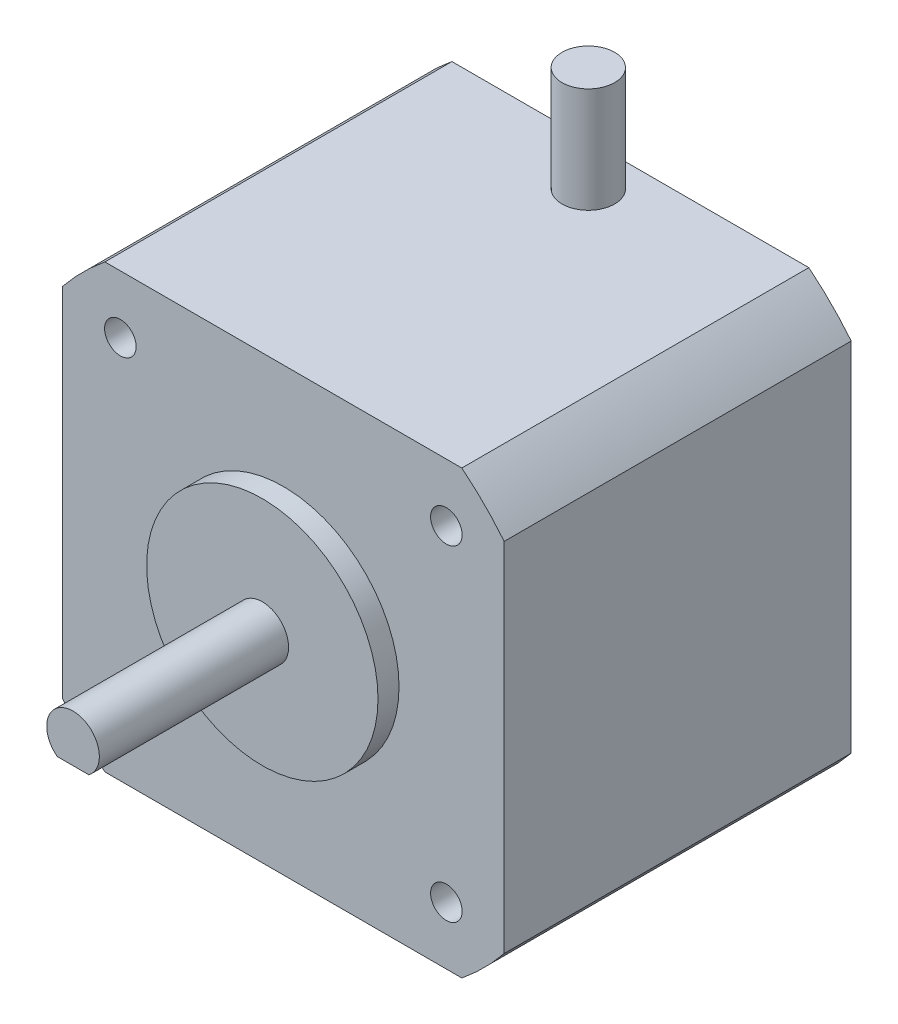
ISO-10303-21;
HEADER;
FILE_DESCRIPTION(('STEP AP214'),'2;1');
FILE_NAME('part.step','',(''),(''),'','','');
FILE_SCHEMA(('AUTOMOTIVE_DESIGN { 1 0 10303 214 1 1 1 1 }'));
ENDSEC;
DATA;
#1=APPLICATION_CONTEXT('core data for automotive mechanical design processes');
#2=APPLICATION_PROTOCOL_DEFINITION('international standard','automotive_design',2000,#1);
#3=PRODUCT_CONTEXT('',#1,'mechanical');
#4=PRODUCT('Part','Part','',(#3));
#5=PRODUCT_RELATED_PRODUCT_CATEGORY('part','',(#4));
#6=PRODUCT_DEFINITION_FORMATION('','',#4);
#7=PRODUCT_DEFINITION_CONTEXT('part definition',#1,'design');
#8=PRODUCT_DEFINITION('design','',#6,#7);
#9=PRODUCT_DEFINITION_SHAPE('','',#8);
#10=(LENGTH_UNIT() NAMED_UNIT(*) SI_UNIT(.MILLI.,.METRE.));
#11=(NAMED_UNIT(*) PLANE_ANGLE_UNIT() SI_UNIT($,.RADIAN.));
#12=(NAMED_UNIT(*) SI_UNIT($,.STERADIAN.) SOLID_ANGLE_UNIT());
#13=UNCERTAINTY_MEASURE_WITH_UNIT(LENGTH_MEASURE(1.E-05),#10,'distance_accuracy_value','');
#14=(GEOMETRIC_REPRESENTATION_CONTEXT(3) GLOBAL_UNCERTAINTY_ASSIGNED_CONTEXT((#13)) GLOBAL_UNIT_ASSIGNED_CONTEXT((#10,
#11,#12)) REPRESENTATION_CONTEXT('',''));
#15=CARTESIAN_POINT('',(0.,0.,0.));
#16=DIRECTION('',(0.,0.,1.));
#17=DIRECTION('',(1.,0.,0.));
#18=AXIS2_PLACEMENT_3D('',#15,#16,#17);
#19=CARTESIAN_POINT('',(-21.,-21.,-33.));
#20=DIRECTION('',(-1.,0.,0.));
#21=DIRECTION('',(0.,0.,1.));
#22=AXIS2_PLACEMENT_3D('',#19,#20,#21);
#23=PLANE('',#22);
#24=DIRECTION('',(0.,-1.,0.));
#25=VECTOR('',#24,1.);
#26=CARTESIAN_POINT('',(-21.,-21.,-33.));
#27=LINE('',#26,#25);
#28=CARTESIAN_POINT('',(-21.,16.9705627484771,-33.));
#29=VERTEX_POINT('',#28);
#30=CARTESIAN_POINT('',(-21.,-16.9705627484771,-33.));
#31=VERTEX_POINT('',#30);
#32=EDGE_CURVE('E151',#29,#31,#27,.T.);
#33=ORIENTED_EDGE('',*,*,#32,.T.);
#34=DIRECTION('',(0.,0.,1.));
#35=VECTOR('',#34,1.);
#36=CARTESIAN_POINT('',(-21.,-16.9705627484771,-33.));
#37=LINE('',#36,#35);
#38=CARTESIAN_POINT('',(-21.,-16.9705627484771,0.));
#39=VERTEX_POINT('',#38);
#40=EDGE_CURVE('E241',#31,#39,#37,.T.);
#41=ORIENTED_EDGE('',*,*,#40,.T.);
#42=DIRECTION('',(0.,-1.,0.));
#43=VECTOR('',#42,1.);
#44=CARTESIAN_POINT('',(-21.,-21.,0.));
#45=LINE('',#44,#43);
#46=CARTESIAN_POINT('',(-21.,16.9705627484771,0.));
#47=VERTEX_POINT('',#46);
#48=EDGE_CURVE('E155',#47,#39,#45,.T.);
#49=ORIENTED_EDGE('',*,*,#48,.F.);
#50=DIRECTION('',(0.,0.,1.));
#51=VECTOR('',#50,1.);
#52=CARTESIAN_POINT('',(-21.,16.9705627484771,-33.));
#53=LINE('',#52,#51);
#54=EDGE_CURVE('E243',#47,#29,#53,.F.);
#55=ORIENTED_EDGE('',*,*,#54,.T.);
#56=EDGE_LOOP('',(#33,#41,#49,#55));
#57=FACE_BOUND('',#56,.T.);
#58=ADVANCED_FACE('F36',(#57),#23,.T.);
#59=CARTESIAN_POINT('',(21.,21.,-33.));
#60=DIRECTION('',(0.,1.,0.));
#61=DIRECTION('',(-1.,0.,0.));
#62=AXIS2_PLACEMENT_3D('',#59,#60,#61);
#63=PLANE('',#62);
#64=CARTESIAN_POINT('',(0.,21.,-29.));
#65=DIRECTION('',(0.,1.,0.));
#66=DIRECTION('',(-1.,0.,0.));
#67=AXIS2_PLACEMENT_3D('',#64,#65,#66);
#68=CIRCLE('',#67,2.5);
#69=CARTESIAN_POINT('',(-2.5,21.,-29.));
#70=VERTEX_POINT('',#69);
#71=EDGE_CURVE('E257',#70,#70,#68,.T.);
#72=ORIENTED_EDGE('',*,*,#71,.F.);
#73=EDGE_LOOP('',(#72));
#74=FACE_BOUND('',#73,.T.);
#75=DIRECTION('',(-1.,0.,0.));
#76=VECTOR('',#75,1.);
#77=CARTESIAN_POINT('',(21.,21.,-33.));
#78=LINE('',#77,#76);
#79=CARTESIAN_POINT('',(16.9705627484771,21.,-33.));
#80=VERTEX_POINT('',#79);
#81=CARTESIAN_POINT('',(-16.9705627484771,21.,-33.));
#82=VERTEX_POINT('',#81);
#83=EDGE_CURVE('E141',#80,#82,#78,.T.);
#84=ORIENTED_EDGE('',*,*,#83,.T.);
#85=DIRECTION('',(0.,0.,1.));
#86=VECTOR('',#85,1.);
#87=CARTESIAN_POINT('',(-16.9705627484771,21.,-33.));
#88=LINE('',#87,#86);
#89=CARTESIAN_POINT('',(-16.9705627484771,21.,0.));
#90=VERTEX_POINT('',#89);
#91=EDGE_CURVE('E245',#82,#90,#88,.T.);
#92=ORIENTED_EDGE('',*,*,#91,.T.);
#93=DIRECTION('',(-1.,0.,0.));
#94=VECTOR('',#93,1.);
#95=CARTESIAN_POINT('',(21.,21.,0.));
#96=LINE('',#95,#94);
#97=CARTESIAN_POINT('',(16.9705627484771,21.,0.));
#98=VERTEX_POINT('',#97);
#99=EDGE_CURVE('E163',#98,#90,#96,.T.);
#100=ORIENTED_EDGE('',*,*,#99,.F.);
#101=DIRECTION('',(0.,0.,1.));
#102=VECTOR('',#101,1.);
#103=CARTESIAN_POINT('',(16.9705627484771,21.,-33.));
#104=LINE('',#103,#102);
#105=EDGE_CURVE('E51',#98,#80,#104,.F.);
#106=ORIENTED_EDGE('',*,*,#105,.T.);
#107=EDGE_LOOP('',(#84,#92,#100,#106));
#108=FACE_BOUND('',#107,.T.);
#109=ADVANCED_FACE('F271',(#74,#108),#63,.T.);
#110=CARTESIAN_POINT('',(21.,-21.,-33.));
#111=DIRECTION('',(1.,0.,0.));
#112=DIRECTION('',(0.,0.,-1.));
#113=AXIS2_PLACEMENT_3D('',#110,#111,#112);
#114=PLANE('',#113);
#115=DIRECTION('',(0.,1.,0.));
#116=VECTOR('',#115,1.);
#117=CARTESIAN_POINT('',(21.,-21.,-33.));
#118=LINE('',#117,#116);
#119=CARTESIAN_POINT('',(21.,-16.9705627484771,-33.));
#120=VERTEX_POINT('',#119);
#121=CARTESIAN_POINT('',(21.,16.9705627484771,-33.));
#122=VERTEX_POINT('',#121);
#123=EDGE_CURVE('E138',#120,#122,#118,.T.);
#124=ORIENTED_EDGE('',*,*,#123,.T.);
#125=DIRECTION('',(0.,0.,1.));
#126=VECTOR('',#125,1.);
#127=CARTESIAN_POINT('',(21.,16.9705627484771,-33.));
#128=LINE('',#127,#126);
#129=CARTESIAN_POINT('',(21.,16.9705627484771,0.));
#130=VERTEX_POINT('',#129);
#131=EDGE_CURVE('E123',#122,#130,#128,.T.);
#132=ORIENTED_EDGE('',*,*,#131,.T.);
#133=DIRECTION('',(0.,1.,0.));
#134=VECTOR('',#133,1.);
#135=CARTESIAN_POINT('',(21.,-21.,0.));
#136=LINE('',#135,#134);
#137=CARTESIAN_POINT('',(21.,-16.9705627484771,0.));
#138=VERTEX_POINT('',#137);
#139=EDGE_CURVE('E162',#138,#130,#136,.T.);
#140=ORIENTED_EDGE('',*,*,#139,.F.);
#141=DIRECTION('',(0.,0.,1.));
#142=VECTOR('',#141,1.);
#143=CARTESIAN_POINT('',(21.,-16.9705627484771,-33.));
#144=LINE('',#143,#142);
#145=EDGE_CURVE('E59',#138,#120,#144,.F.);
#146=ORIENTED_EDGE('',*,*,#145,.T.);
#147=EDGE_LOOP('',(#124,#132,#140,#146));
#148=FACE_BOUND('',#147,.T.);
#149=ADVANCED_FACE('F146',(#148),#114,.T.);
#150=CARTESIAN_POINT('',(21.,-21.,-33.));
#151=DIRECTION('',(0.,-1.,0.));
#152=DIRECTION('',(1.,0.,0.));
#153=AXIS2_PLACEMENT_3D('',#150,#151,#152);
#154=PLANE('',#153);
#155=DIRECTION('',(1.,0.,0.));
#156=VECTOR('',#155,1.);
#157=CARTESIAN_POINT('',(21.,-21.,-33.));
#158=LINE('',#157,#156);
#159=CARTESIAN_POINT('',(-16.9705627484771,-21.,-33.));
#160=VERTEX_POINT('',#159);
#161=CARTESIAN_POINT('',(16.9705627484771,-21.,-33.));
#162=VERTEX_POINT('',#161);
#163=EDGE_CURVE('E147',#160,#162,#158,.T.);
#164=ORIENTED_EDGE('',*,*,#163,.T.);
#165=DIRECTION('',(0.,0.,1.));
#166=VECTOR('',#165,1.);
#167=CARTESIAN_POINT('',(16.9705627484771,-21.,-33.));
#168=LINE('',#167,#166);
#169=CARTESIAN_POINT('',(16.9705627484771,-21.,0.));
#170=VERTEX_POINT('',#169);
#171=EDGE_CURVE('E250',#162,#170,#168,.T.);
#172=ORIENTED_EDGE('',*,*,#171,.T.);
#173=DIRECTION('',(1.,0.,0.));
#174=VECTOR('',#173,1.);
#175=CARTESIAN_POINT('',(21.,-21.,0.));
#176=LINE('',#175,#174);
#177=CARTESIAN_POINT('',(-16.9705627484771,-21.,0.));
#178=VERTEX_POINT('',#177);
#179=EDGE_CURVE('E158',#178,#170,#176,.T.);
#180=ORIENTED_EDGE('',*,*,#179,.F.);
#181=DIRECTION('',(0.,0.,1.));
#182=VECTOR('',#181,1.);
#183=CARTESIAN_POINT('',(-16.9705627484771,-21.,-33.));
#184=LINE('',#183,#182);
#185=EDGE_CURVE('E142',#178,#160,#184,.F.);
#186=ORIENTED_EDGE('',*,*,#185,.T.);
#187=EDGE_LOOP('',(#164,#172,#180,#186));
#188=FACE_BOUND('',#187,.T.);
#189=ADVANCED_FACE('F283',(#188),#154,.T.);
#190=CARTESIAN_POINT('',(0.,0.,-33.));
#191=DIRECTION('',(0.,0.,1.));
#192=DIRECTION('',(1.,0.,0.));
#193=AXIS2_PLACEMENT_3D('',#190,#191,#192);
#194=PLANE('',#193);
#195=CARTESIAN_POINT('',(0.,0.,-33.));
#196=DIRECTION('',(0.,0.,1.));
#197=DIRECTION('',(1.,0.,0.));
#198=AXIS2_PLACEMENT_3D('',#195,#196,#197);
#199=CIRCLE('',#198,27.);
#200=EDGE_CURVE('E126',#122,#80,#199,.T.);
#201=ORIENTED_EDGE('',*,*,#200,.F.);
#202=ORIENTED_EDGE('',*,*,#123,.F.);
#203=EDGE_CURVE('E145',#162,#120,#199,.T.);
#204=ORIENTED_EDGE('',*,*,#203,.F.);
#205=ORIENTED_EDGE('',*,*,#163,.F.);
#206=EDGE_CURVE('E278',#31,#160,#199,.T.);
#207=ORIENTED_EDGE('',*,*,#206,.F.);
#208=ORIENTED_EDGE('',*,*,#32,.F.);
#209=EDGE_CURVE('E143',#82,#29,#199,.T.);
#210=ORIENTED_EDGE('',*,*,#209,.F.);
#211=ORIENTED_EDGE('',*,*,#83,.F.);
#212=EDGE_LOOP('',(#201,#202,#204,#205,#207,#208,#210,#211));
#213=FACE_BOUND('',#212,.T.);
#214=ADVANCED_FACE('F136',(#213),#194,.F.);
#215=CARTESIAN_POINT('',(0.,0.,0.));
#216=DIRECTION('',(0.,0.,1.));
#217=DIRECTION('',(1.,0.,0.));
#218=AXIS2_PLACEMENT_3D('',#215,#216,#217);
#219=PLANE('',#218);
#220=CARTESIAN_POINT('',(-15.5000000000002,15.5,0.));
#221=DIRECTION('',(0.,0.,1.));
#222=DIRECTION('',(1.,0.,0.));
#223=AXIS2_PLACEMENT_3D('',#220,#221,#222);
#224=CIRCLE('',#223,1.49999999999999);
#225=CARTESIAN_POINT('',(-14.0000000000002,15.5,0.));
#226=VERTEX_POINT('',#225);
#227=EDGE_CURVE('E238',#226,#226,#224,.T.);
#228=ORIENTED_EDGE('',*,*,#227,.F.);
#229=EDGE_LOOP('',(#228));
#230=FACE_BOUND('',#229,.T.);
#231=CARTESIAN_POINT('',(15.5000000000002,15.5,0.));
#232=DIRECTION('',(0.,0.,1.));
#233=DIRECTION('',(1.,0.,0.));
#234=AXIS2_PLACEMENT_3D('',#231,#232,#233);
#235=CIRCLE('',#234,1.49999999999999);
#236=CARTESIAN_POINT('',(17.0000000000002,15.5,0.));
#237=VERTEX_POINT('',#236);
#238=EDGE_CURVE('E226',#237,#237,#235,.T.);
#239=ORIENTED_EDGE('',*,*,#238,.F.);
#240=EDGE_LOOP('',(#239));
#241=FACE_BOUND('',#240,.T.);
#242=CARTESIAN_POINT('',(15.5000000000002,-15.5,0.));
#243=DIRECTION('',(0.,0.,1.));
#244=DIRECTION('',(1.,0.,0.));
#245=AXIS2_PLACEMENT_3D('',#242,#243,#244);
#246=CIRCLE('',#245,1.49999999999999);
#247=CARTESIAN_POINT('',(17.0000000000002,-15.5,0.));
#248=VERTEX_POINT('',#247);
#249=EDGE_CURVE('E214',#248,#248,#246,.T.);
#250=ORIENTED_EDGE('',*,*,#249,.F.);
#251=EDGE_LOOP('',(#250));
#252=FACE_BOUND('',#251,.T.);
#253=CARTESIAN_POINT('',(-15.5000000000002,-15.5,0.));
#254=DIRECTION('',(0.,0.,1.));
#255=DIRECTION('',(1.,0.,0.));
#256=AXIS2_PLACEMENT_3D('',#253,#254,#255);
#257=CIRCLE('',#256,1.49999999999999);
#258=CARTESIAN_POINT('',(-14.0000000000002,-15.5,0.));
#259=VERTEX_POINT('',#258);
#260=EDGE_CURVE('E202',#259,#259,#257,.T.);
#261=ORIENTED_EDGE('',*,*,#260,.F.);
#262=EDGE_LOOP('',(#261));
#263=FACE_BOUND('',#262,.T.);
#264=CARTESIAN_POINT('',(0.,0.,0.));
#265=DIRECTION('',(0.,0.,1.));
#266=DIRECTION('',(1.,0.,0.));
#267=AXIS2_PLACEMENT_3D('',#264,#265,#266);
#268=CIRCLE('',#267,11.);
#269=CARTESIAN_POINT('',(11.,0.,0.));
#270=VERTEX_POINT('',#269);
#271=EDGE_CURVE('E173',#270,#270,#268,.T.);
#272=ORIENTED_EDGE('',*,*,#271,.F.);
#273=EDGE_LOOP('',(#272));
#274=FACE_BOUND('',#273,.T.);
#275=ORIENTED_EDGE('',*,*,#139,.T.);
#276=CARTESIAN_POINT('',(0.,0.,0.));
#277=DIRECTION('',(0.,0.,1.));
#278=DIRECTION('',(1.,0.,0.));
#279=AXIS2_PLACEMENT_3D('',#276,#277,#278);
#280=CIRCLE('',#279,27.);
#281=EDGE_CURVE('E127',#130,#98,#280,.T.);
#282=ORIENTED_EDGE('',*,*,#281,.T.);
#283=ORIENTED_EDGE('',*,*,#99,.T.);
#284=CARTESIAN_POINT('',(0.,0.,0.));
#285=DIRECTION('',(0.,0.,1.));
#286=DIRECTION('',(1.,0.,0.));
#287=AXIS2_PLACEMENT_3D('',#284,#285,#286);
#288=CIRCLE('',#287,27.);
#289=EDGE_CURVE('E12',#90,#47,#288,.T.);
#290=ORIENTED_EDGE('',*,*,#289,.T.);
#291=ORIENTED_EDGE('',*,*,#48,.T.);
#292=EDGE_CURVE('E44',#39,#178,#288,.T.);
#293=ORIENTED_EDGE('',*,*,#292,.T.);
#294=ORIENTED_EDGE('',*,*,#179,.T.);
#295=EDGE_CURVE('E39',#170,#138,#288,.T.);
#296=ORIENTED_EDGE('',*,*,#295,.T.);
#297=EDGE_LOOP('',(#275,#282,#283,#290,#291,#293,#294,#296));
#298=FACE_BOUND('',#297,.T.);
#299=ADVANCED_FACE('F287',(#230,#241,#252,#263,#274,#298),#219,.T.);
#300=CARTESIAN_POINT('',(0.,0.,2.));
#301=DIRECTION('',(0.,0.,-1.));
#302=DIRECTION('',(-1.,0.,0.));
#303=AXIS2_PLACEMENT_3D('',#300,#301,#302);
#304=CYLINDRICAL_SURFACE('',#303,11.);
#305=CARTESIAN_POINT('',(0.,0.,2.));
#306=DIRECTION('',(0.,0.,1.));
#307=DIRECTION('',(1.,0.,0.));
#308=AXIS2_PLACEMENT_3D('',#305,#306,#307);
#309=CIRCLE('',#308,11.);
#310=CARTESIAN_POINT('',(11.,0.,2.));
#311=VERTEX_POINT('',#310);
#312=EDGE_CURVE('E159',#311,#311,#309,.T.);
#313=ORIENTED_EDGE('',*,*,#312,.F.);
#314=EDGE_LOOP('',(#313));
#315=FACE_BOUND('',#314,.T.);
#316=ORIENTED_EDGE('',*,*,#271,.T.);
#317=EDGE_LOOP('',(#316));
#318=FACE_BOUND('',#317,.T.);
#319=ADVANCED_FACE('F324',(#315,#318),#304,.T.);
#320=CARTESIAN_POINT('',(0.,0.,2.));
#321=DIRECTION('',(0.,0.,1.));
#322=DIRECTION('',(1.,0.,0.));
#323=AXIS2_PLACEMENT_3D('',#320,#321,#322);
#324=PLANE('',#323);
#325=CARTESIAN_POINT('',(0.,0.,2.));
#326=DIRECTION('',(0.,0.,1.));
#327=DIRECTION('',(1.,0.,0.));
#328=AXIS2_PLACEMENT_3D('',#325,#326,#327);
#329=CIRCLE('',#328,2.5);
#330=CARTESIAN_POINT('',(1.5,-2.,2.));
#331=VERTEX_POINT('',#330);
#332=CARTESIAN_POINT('',(-1.5,-2.,2.));
#333=VERTEX_POINT('',#332);
#334=EDGE_CURVE('E179',#331,#333,#329,.T.);
#335=ORIENTED_EDGE('',*,*,#334,.F.);
#336=DIRECTION('',(1.,0.,0.));
#337=VECTOR('',#336,1.);
#338=CARTESIAN_POINT('',(1.5,-2.,2.));
#339=LINE('',#338,#337);
#340=EDGE_CURVE('E182',#333,#331,#339,.T.);
#341=ORIENTED_EDGE('',*,*,#340,.F.);
#342=EDGE_LOOP('',(#335,#341));
#343=FACE_BOUND('',#342,.T.);
#344=ORIENTED_EDGE('',*,*,#312,.T.);
#345=EDGE_LOOP('',(#344));
#346=FACE_BOUND('',#345,.T.);
#347=ADVANCED_FACE('F333',(#343,#346),#324,.T.);
#348=CARTESIAN_POINT('',(0.,0.,20.));
#349=DIRECTION('',(0.,0.,-1.));
#350=DIRECTION('',(-1.,0.,0.));
#351=AXIS2_PLACEMENT_3D('',#348,#349,#350);
#352=CYLINDRICAL_SURFACE('',#351,2.5);
#353=CARTESIAN_POINT('',(0.,0.,20.));
#354=DIRECTION('',(0.,0.,1.));
#355=DIRECTION('',(1.,0.,0.));
#356=AXIS2_PLACEMENT_3D('',#353,#354,#355);
#357=CIRCLE('',#356,2.5);
#358=CARTESIAN_POINT('',(1.5,-2.,20.));
#359=VERTEX_POINT('',#358);
#360=CARTESIAN_POINT('',(-1.5,-2.,20.));
#361=VERTEX_POINT('',#360);
#362=EDGE_CURVE('E176',#359,#361,#357,.T.);
#363=ORIENTED_EDGE('',*,*,#362,.F.);
#364=DIRECTION('',(0.,0.,1.));
#365=VECTOR('',#364,1.);
#366=CARTESIAN_POINT('',(1.5,-2.,-1.04138126514911));
#367=LINE('',#366,#365);
#368=EDGE_CURVE('E187',#331,#359,#367,.T.);
#369=ORIENTED_EDGE('',*,*,#368,.F.);
#370=ORIENTED_EDGE('',*,*,#334,.T.);
#371=DIRECTION('',(0.,0.,1.));
#372=VECTOR('',#371,1.);
#373=CARTESIAN_POINT('',(-1.5,-2.,-1.04138126514911));
#374=LINE('',#373,#372);
#375=EDGE_CURVE('E186',#333,#361,#374,.T.);
#376=ORIENTED_EDGE('',*,*,#375,.T.);
#377=EDGE_LOOP('',(#363,#369,#370,#376));
#378=FACE_BOUND('',#377,.T.);
#379=ADVANCED_FACE('F341',(#378),#352,.T.);
#380=CARTESIAN_POINT('',(0.,0.,20.));
#381=DIRECTION('',(0.,0.,1.));
#382=DIRECTION('',(1.,0.,0.));
#383=AXIS2_PLACEMENT_3D('',#380,#381,#382);
#384=PLANE('',#383);
#385=DIRECTION('',(-1.,0.,0.));
#386=VECTOR('',#385,1.);
#387=CARTESIAN_POINT('',(1.5,-2.,20.));
#388=LINE('',#387,#386);
#389=EDGE_CURVE('E189',#359,#361,#388,.T.);
#390=ORIENTED_EDGE('',*,*,#389,.F.);
#391=ORIENTED_EDGE('',*,*,#362,.T.);
#392=EDGE_LOOP('',(#390,#391));
#393=FACE_BOUND('',#392,.T.);
#394=ADVANCED_FACE('F349',(#393),#384,.T.);
#395=CARTESIAN_POINT('',(1.5,-2.,-1.04138126514911));
#396=DIRECTION('',(0.,1.,0.));
#397=DIRECTION('',(0.,0.,1.));
#398=AXIS2_PLACEMENT_3D('',#395,#396,#397);
#399=PLANE('',#398);
#400=ORIENTED_EDGE('',*,*,#340,.T.);
#401=ORIENTED_EDGE('',*,*,#368,.T.);
#402=ORIENTED_EDGE('',*,*,#389,.T.);
#403=ORIENTED_EDGE('',*,*,#375,.F.);
#404=EDGE_LOOP('',(#400,#401,#402,#403));
#405=FACE_BOUND('',#404,.T.);
#406=ADVANCED_FACE('F357',(#405),#399,.F.);
#407=CARTESIAN_POINT('',(-15.5000000000002,-15.5,-7.49999999999999));
#408=DIRECTION('',(0.,0.,1.));
#409=DIRECTION('',(1.,0.,0.));
#410=AXIS2_PLACEMENT_3D('',#407,#408,#409);
#411=CONICAL_SURFACE('',#410,1.25,1.02974425867665);
#412=CARTESIAN_POINT('',(-15.5000000000002,-15.5,-8.25107577378444));
#413=VERTEX_POINT('',#412);
#414=VERTEX_LOOP('',#413);
#415=FACE_BOUND('',#414,.T.);
#416=CARTESIAN_POINT('',(-15.5000000000002,-15.5,-7.49999999999999));
#417=DIRECTION('',(0.,0.,1.));
#418=DIRECTION('',(1.,0.,0.));
#419=AXIS2_PLACEMENT_3D('',#416,#417,#418);
#420=CIRCLE('',#419,1.25);
#421=CARTESIAN_POINT('',(-14.2500000000002,-15.5,-7.49999999999999));
#422=VERTEX_POINT('',#421);
#423=EDGE_CURVE('E193',#422,#422,#420,.T.);
#424=ORIENTED_EDGE('',*,*,#423,.T.);
#425=EDGE_LOOP('',(#424));
#426=FACE_BOUND('',#425,.T.);
#427=ADVANCED_FACE('F365',(#415,#426),#411,.F.);
#428=CARTESIAN_POINT('',(-15.5000000000002,-15.5,0.));
#429=DIRECTION('',(0.,0.,1.));
#430=DIRECTION('',(1.,0.,0.));
#431=AXIS2_PLACEMENT_3D('',#428,#429,#430);
#432=CYLINDRICAL_SURFACE('',#431,1.25);
#433=ORIENTED_EDGE('',*,*,#423,.F.);
#434=EDGE_LOOP('',(#433));
#435=FACE_BOUND('',#434,.T.);
#436=CARTESIAN_POINT('',(-15.5000000000002,-15.5,-6.));
#437=DIRECTION('',(0.,0.,1.));
#438=DIRECTION('',(1.,0.,0.));
#439=AXIS2_PLACEMENT_3D('',#436,#437,#438);
#440=CIRCLE('',#439,1.25);
#441=CARTESIAN_POINT('',(-14.2500000000002,-15.5,-6.));
#442=VERTEX_POINT('',#441);
#443=EDGE_CURVE('E196',#442,#442,#440,.T.);
#444=ORIENTED_EDGE('',*,*,#443,.T.);
#445=EDGE_LOOP('',(#444));
#446=FACE_BOUND('',#445,.T.);
#447=ADVANCED_FACE('F373',(#435,#446),#432,.F.);
#448=CARTESIAN_POINT('',(-14.2500000000002,-15.5,-6.));
#449=DIRECTION('',(0.,0.,-1.));
#450=DIRECTION('',(-1.,0.,0.));
#451=AXIS2_PLACEMENT_3D('',#448,#449,#450);
#452=PLANE('',#451);
#453=ORIENTED_EDGE('',*,*,#443,.F.);
#454=EDGE_LOOP('',(#453));
#455=FACE_BOUND('',#454,.T.);
#456=CARTESIAN_POINT('',(-15.5000000000002,-15.5,-6.));
#457=DIRECTION('',(0.,0.,1.));
#458=DIRECTION('',(1.,0.,0.));
#459=AXIS2_PLACEMENT_3D('',#456,#457,#458);
#460=CIRCLE('',#459,1.49999999999999);
#461=CARTESIAN_POINT('',(-14.0000000000002,-15.5,-6.));
#462=VERTEX_POINT('',#461);
#463=EDGE_CURVE('E199',#462,#462,#460,.T.);
#464=ORIENTED_EDGE('',*,*,#463,.T.);
#465=EDGE_LOOP('',(#464));
#466=FACE_BOUND('',#465,.T.);
#467=ADVANCED_FACE('F381',(#455,#466),#452,.F.);
#468=CARTESIAN_POINT('',(-15.5000000000002,-15.5,0.));
#469=DIRECTION('',(0.,0.,1.));
#470=DIRECTION('',(1.,0.,0.));
#471=AXIS2_PLACEMENT_3D('',#468,#469,#470);
#472=CYLINDRICAL_SURFACE('',#471,1.49999999999999);
#473=ORIENTED_EDGE('',*,*,#463,.F.);
#474=EDGE_LOOP('',(#473));
#475=FACE_BOUND('',#474,.T.);
#476=ORIENTED_EDGE('',*,*,#260,.T.);
#477=EDGE_LOOP('',(#476));
#478=FACE_BOUND('',#477,.T.);
#479=ADVANCED_FACE('F389',(#475,#478),#472,.F.);
#480=CARTESIAN_POINT('',(15.5000000000002,-15.5,-7.49999999999999));
#481=DIRECTION('',(0.,0.,1.));
#482=DIRECTION('',(1.,0.,0.));
#483=AXIS2_PLACEMENT_3D('',#480,#481,#482);
#484=CONICAL_SURFACE('',#483,1.25,1.02974425867665);
#485=CARTESIAN_POINT('',(15.5000000000002,-15.5,-8.25107577378444));
#486=VERTEX_POINT('',#485);
#487=VERTEX_LOOP('',#486);
#488=FACE_BOUND('',#487,.T.);
#489=CARTESIAN_POINT('',(15.5000000000002,-15.5,-7.49999999999999));
#490=DIRECTION('',(0.,0.,1.));
#491=DIRECTION('',(1.,0.,0.));
#492=AXIS2_PLACEMENT_3D('',#489,#490,#491);
#493=CIRCLE('',#492,1.25);
#494=CARTESIAN_POINT('',(16.7500000000002,-15.5,-7.49999999999999));
#495=VERTEX_POINT('',#494);
#496=EDGE_CURVE('E205',#495,#495,#493,.T.);
#497=ORIENTED_EDGE('',*,*,#496,.T.);
#498=EDGE_LOOP('',(#497));
#499=FACE_BOUND('',#498,.T.);
#500=ADVANCED_FACE('F398',(#488,#499),#484,.F.);
#501=CARTESIAN_POINT('',(15.5000000000002,-15.5,0.));
#502=DIRECTION('',(0.,0.,1.));
#503=DIRECTION('',(1.,0.,0.));
#504=AXIS2_PLACEMENT_3D('',#501,#502,#503);
#505=CYLINDRICAL_SURFACE('',#504,1.25);
#506=ORIENTED_EDGE('',*,*,#496,.F.);
#507=EDGE_LOOP('',(#506));
#508=FACE_BOUND('',#507,.T.);
#509=CARTESIAN_POINT('',(15.5000000000002,-15.5,-6.));
#510=DIRECTION('',(0.,0.,1.));
#511=DIRECTION('',(1.,0.,0.));
#512=AXIS2_PLACEMENT_3D('',#509,#510,#511);
#513=CIRCLE('',#512,1.25);
#514=CARTESIAN_POINT('',(16.7500000000002,-15.5,-6.));
#515=VERTEX_POINT('',#514);
#516=EDGE_CURVE('E208',#515,#515,#513,.T.);
#517=ORIENTED_EDGE('',*,*,#516,.T.);
#518=EDGE_LOOP('',(#517));
#519=FACE_BOUND('',#518,.T.);
#520=ADVANCED_FACE('F406',(#508,#519),#505,.F.);
#521=CARTESIAN_POINT('',(16.7500000000002,-15.5,-6.));
#522=DIRECTION('',(0.,0.,-1.));
#523=DIRECTION('',(-1.,0.,0.));
#524=AXIS2_PLACEMENT_3D('',#521,#522,#523);
#525=PLANE('',#524);
#526=ORIENTED_EDGE('',*,*,#516,.F.);
#527=EDGE_LOOP('',(#526));
#528=FACE_BOUND('',#527,.T.);
#529=CARTESIAN_POINT('',(15.5000000000002,-15.5,-6.));
#530=DIRECTION('',(0.,0.,1.));
#531=DIRECTION('',(1.,0.,0.));
#532=AXIS2_PLACEMENT_3D('',#529,#530,#531);
#533=CIRCLE('',#532,1.49999999999999);
#534=CARTESIAN_POINT('',(17.0000000000002,-15.5,-6.));
#535=VERTEX_POINT('',#534);
#536=EDGE_CURVE('E211',#535,#535,#533,.T.);
#537=ORIENTED_EDGE('',*,*,#536,.T.);
#538=EDGE_LOOP('',(#537));
#539=FACE_BOUND('',#538,.T.);
#540=ADVANCED_FACE('F414',(#528,#539),#525,.F.);
#541=CARTESIAN_POINT('',(15.5000000000002,-15.5,0.));
#542=DIRECTION('',(0.,0.,1.));
#543=DIRECTION('',(1.,0.,0.));
#544=AXIS2_PLACEMENT_3D('',#541,#542,#543);
#545=CYLINDRICAL_SURFACE('',#544,1.49999999999999);
#546=ORIENTED_EDGE('',*,*,#536,.F.);
#547=EDGE_LOOP('',(#546));
#548=FACE_BOUND('',#547,.T.);
#549=ORIENTED_EDGE('',*,*,#249,.T.);
#550=EDGE_LOOP('',(#549));
#551=FACE_BOUND('',#550,.T.);
#552=ADVANCED_FACE('F422',(#548,#551),#545,.F.);
#553=CARTESIAN_POINT('',(15.5000000000002,15.5,-7.49999999999999));
#554=DIRECTION('',(0.,0.,1.));
#555=DIRECTION('',(1.,0.,0.));
#556=AXIS2_PLACEMENT_3D('',#553,#554,#555);
#557=CONICAL_SURFACE('',#556,1.25,1.02974425867665);
#558=CARTESIAN_POINT('',(15.5000000000002,15.5,-8.25107577378444));
#559=VERTEX_POINT('',#558);
#560=VERTEX_LOOP('',#559);
#561=FACE_BOUND('',#560,.T.);
#562=CARTESIAN_POINT('',(15.5000000000002,15.5,-7.49999999999999));
#563=DIRECTION('',(0.,0.,1.));
#564=DIRECTION('',(1.,0.,0.));
#565=AXIS2_PLACEMENT_3D('',#562,#563,#564);
#566=CIRCLE('',#565,1.25);
#567=CARTESIAN_POINT('',(16.7500000000002,15.5,-7.49999999999999));
#568=VERTEX_POINT('',#567);
#569=EDGE_CURVE('E217',#568,#568,#566,.T.);
#570=ORIENTED_EDGE('',*,*,#569,.T.);
#571=EDGE_LOOP('',(#570));
#572=FACE_BOUND('',#571,.T.);
#573=ADVANCED_FACE('F430',(#561,#572),#557,.F.);
#574=CARTESIAN_POINT('',(15.5000000000002,15.5,0.));
#575=DIRECTION('',(0.,0.,1.));
#576=DIRECTION('',(1.,0.,0.));
#577=AXIS2_PLACEMENT_3D('',#574,#575,#576);
#578=CYLINDRICAL_SURFACE('',#577,1.25);
#579=ORIENTED_EDGE('',*,*,#569,.F.);
#580=EDGE_LOOP('',(#579));
#581=FACE_BOUND('',#580,.T.);
#582=CARTESIAN_POINT('',(15.5000000000002,15.5,-6.));
#583=DIRECTION('',(0.,0.,1.));
#584=DIRECTION('',(1.,0.,0.));
#585=AXIS2_PLACEMENT_3D('',#582,#583,#584);
#586=CIRCLE('',#585,1.25);
#587=CARTESIAN_POINT('',(16.7500000000002,15.5,-6.));
#588=VERTEX_POINT('',#587);
#589=EDGE_CURVE('E220',#588,#588,#586,.T.);
#590=ORIENTED_EDGE('',*,*,#589,.T.);
#591=EDGE_LOOP('',(#590));
#592=FACE_BOUND('',#591,.T.);
#593=ADVANCED_FACE('F438',(#581,#592),#578,.F.);
#594=CARTESIAN_POINT('',(16.7500000000002,15.5,-6.));
#595=DIRECTION('',(0.,0.,-1.));
#596=DIRECTION('',(-1.,0.,0.));
#597=AXIS2_PLACEMENT_3D('',#594,#595,#596);
#598=PLANE('',#597);
#599=ORIENTED_EDGE('',*,*,#589,.F.);
#600=EDGE_LOOP('',(#599));
#601=FACE_BOUND('',#600,.T.);
#602=CARTESIAN_POINT('',(15.5000000000002,15.5,-6.));
#603=DIRECTION('',(0.,0.,1.));
#604=DIRECTION('',(1.,0.,0.));
#605=AXIS2_PLACEMENT_3D('',#602,#603,#604);
#606=CIRCLE('',#605,1.49999999999999);
#607=CARTESIAN_POINT('',(17.0000000000002,15.5,-6.));
#608=VERTEX_POINT('',#607);
#609=EDGE_CURVE('E223',#608,#608,#606,.T.);
#610=ORIENTED_EDGE('',*,*,#609,.T.);
#611=EDGE_LOOP('',(#610));
#612=FACE_BOUND('',#611,.T.);
#613=ADVANCED_FACE('F446',(#601,#612),#598,.F.);
#614=CARTESIAN_POINT('',(15.5000000000002,15.5,0.));
#615=DIRECTION('',(0.,0.,1.));
#616=DIRECTION('',(1.,0.,0.));
#617=AXIS2_PLACEMENT_3D('',#614,#615,#616);
#618=CYLINDRICAL_SURFACE('',#617,1.49999999999999);
#619=ORIENTED_EDGE('',*,*,#609,.F.);
#620=EDGE_LOOP('',(#619));
#621=FACE_BOUND('',#620,.T.);
#622=ORIENTED_EDGE('',*,*,#238,.T.);
#623=EDGE_LOOP('',(#622));
#624=FACE_BOUND('',#623,.T.);
#625=ADVANCED_FACE('F454',(#621,#624),#618,.F.);
#626=CARTESIAN_POINT('',(-15.5000000000002,15.5,-7.49999999999999));
#627=DIRECTION('',(0.,0.,1.));
#628=DIRECTION('',(1.,0.,0.));
#629=AXIS2_PLACEMENT_3D('',#626,#627,#628);
#630=CONICAL_SURFACE('',#629,1.25,1.02974425867665);
#631=CARTESIAN_POINT('',(-15.5000000000002,15.5,-8.25107577378444));
#632=VERTEX_POINT('',#631);
#633=VERTEX_LOOP('',#632);
#634=FACE_BOUND('',#633,.T.);
#635=CARTESIAN_POINT('',(-15.5000000000002,15.5,-7.49999999999999));
#636=DIRECTION('',(0.,0.,1.));
#637=DIRECTION('',(1.,0.,0.));
#638=AXIS2_PLACEMENT_3D('',#635,#636,#637);
#639=CIRCLE('',#638,1.25);
#640=CARTESIAN_POINT('',(-14.2500000000002,15.5,-7.49999999999999));
#641=VERTEX_POINT('',#640);
#642=EDGE_CURVE('E229',#641,#641,#639,.T.);
#643=ORIENTED_EDGE('',*,*,#642,.T.);
#644=EDGE_LOOP('',(#643));
#645=FACE_BOUND('',#644,.T.);
#646=ADVANCED_FACE('F462',(#634,#645),#630,.F.);
#647=CARTESIAN_POINT('',(-15.5000000000002,15.5,0.));
#648=DIRECTION('',(0.,0.,1.));
#649=DIRECTION('',(1.,0.,0.));
#650=AXIS2_PLACEMENT_3D('',#647,#648,#649);
#651=CYLINDRICAL_SURFACE('',#650,1.25);
#652=ORIENTED_EDGE('',*,*,#642,.F.);
#653=EDGE_LOOP('',(#652));
#654=FACE_BOUND('',#653,.T.);
#655=CARTESIAN_POINT('',(-15.5000000000002,15.5,-6.));
#656=DIRECTION('',(0.,0.,1.));
#657=DIRECTION('',(1.,0.,0.));
#658=AXIS2_PLACEMENT_3D('',#655,#656,#657);
#659=CIRCLE('',#658,1.25);
#660=CARTESIAN_POINT('',(-14.2500000000002,15.5,-6.));
#661=VERTEX_POINT('',#660);
#662=EDGE_CURVE('E232',#661,#661,#659,.T.);
#663=ORIENTED_EDGE('',*,*,#662,.T.);
#664=EDGE_LOOP('',(#663));
#665=FACE_BOUND('',#664,.T.);
#666=ADVANCED_FACE('F470',(#654,#665),#651,.F.);
#667=CARTESIAN_POINT('',(-14.2500000000002,15.5,-6.));
#668=DIRECTION('',(0.,0.,-1.));
#669=DIRECTION('',(-1.,0.,0.));
#670=AXIS2_PLACEMENT_3D('',#667,#668,#669);
#671=PLANE('',#670);
#672=ORIENTED_EDGE('',*,*,#662,.F.);
#673=EDGE_LOOP('',(#672));
#674=FACE_BOUND('',#673,.T.);
#675=CARTESIAN_POINT('',(-15.5000000000002,15.5,-6.));
#676=DIRECTION('',(0.,0.,1.));
#677=DIRECTION('',(1.,0.,0.));
#678=AXIS2_PLACEMENT_3D('',#675,#676,#677);
#679=CIRCLE('',#678,1.49999999999999);
#680=CARTESIAN_POINT('',(-14.0000000000002,15.5,-6.));
#681=VERTEX_POINT('',#680);
#682=EDGE_CURVE('E235',#681,#681,#679,.T.);
#683=ORIENTED_EDGE('',*,*,#682,.T.);
#684=EDGE_LOOP('',(#683));
#685=FACE_BOUND('',#684,.T.);
#686=ADVANCED_FACE('F478',(#674,#685),#671,.F.);
#687=CARTESIAN_POINT('',(-15.5000000000002,15.5,0.));
#688=DIRECTION('',(0.,0.,1.));
#689=DIRECTION('',(1.,0.,0.));
#690=AXIS2_PLACEMENT_3D('',#687,#688,#689);
#691=CYLINDRICAL_SURFACE('',#690,1.49999999999999);
#692=ORIENTED_EDGE('',*,*,#682,.F.);
#693=EDGE_LOOP('',(#692));
#694=FACE_BOUND('',#693,.T.);
#695=ORIENTED_EDGE('',*,*,#227,.T.);
#696=EDGE_LOOP('',(#695));
#697=FACE_BOUND('',#696,.T.);
#698=ADVANCED_FACE('F486',(#694,#697),#691,.F.);
#699=CARTESIAN_POINT('',(0.,0.,-33.));
#700=DIRECTION('',(0.,0.,1.));
#701=DIRECTION('',(1.,0.,0.));
#702=AXIS2_PLACEMENT_3D('',#699,#700,#701);
#703=CYLINDRICAL_SURFACE('',#702,27.);
#704=ORIENTED_EDGE('',*,*,#295,.F.);
#705=ORIENTED_EDGE('',*,*,#171,.F.);
#706=ORIENTED_EDGE('',*,*,#203,.T.);
#707=ORIENTED_EDGE('',*,*,#145,.F.);
#708=EDGE_LOOP('',(#704,#705,#706,#707));
#709=FACE_BOUND('',#708,.T.);
#710=ADVANCED_FACE('F280',(#709),#703,.T.);
#711=ORIENTED_EDGE('',*,*,#206,.T.);
#712=ORIENTED_EDGE('',*,*,#185,.F.);
#713=ORIENTED_EDGE('',*,*,#292,.F.);
#714=ORIENTED_EDGE('',*,*,#40,.F.);
#715=EDGE_LOOP('',(#711,#712,#713,#714));
#716=FACE_BOUND('',#715,.T.);
#717=ADVANCED_FACE('F286',(#716),#703,.T.);
#718=ORIENTED_EDGE('',*,*,#289,.F.);
#719=ORIENTED_EDGE('',*,*,#91,.F.);
#720=ORIENTED_EDGE('',*,*,#209,.T.);
#721=ORIENTED_EDGE('',*,*,#54,.F.);
#722=EDGE_LOOP('',(#718,#719,#720,#721));
#723=FACE_BOUND('',#722,.T.);
#724=ADVANCED_FACE('F276',(#723),#703,.T.);
#725=ORIENTED_EDGE('',*,*,#281,.F.);
#726=ORIENTED_EDGE('',*,*,#131,.F.);
#727=ORIENTED_EDGE('',*,*,#200,.T.);
#728=ORIENTED_EDGE('',*,*,#105,.F.);
#729=EDGE_LOOP('',(#725,#726,#727,#728));
#730=FACE_BOUND('',#729,.T.);
#731=ADVANCED_FACE('F125',(#730),#703,.T.);
#732=CARTESIAN_POINT('',(0.,31.,-29.));
#733=DIRECTION('',(0.,-1.,0.));
#734=DIRECTION('',(1.,0.,0.));
#735=AXIS2_PLACEMENT_3D('',#732,#733,#734);
#736=CYLINDRICAL_SURFACE('',#735,2.5);
#737=CARTESIAN_POINT('',(0.,31.,-29.));
#738=DIRECTION('',(0.,1.,0.));
#739=DIRECTION('',(-1.,0.,0.));
#740=AXIS2_PLACEMENT_3D('',#737,#738,#739);
#741=CIRCLE('',#740,2.5);
#742=CARTESIAN_POINT('',(-2.50000000000001,31.,-29.));
#743=VERTEX_POINT('',#742);
#744=EDGE_CURVE('E255',#743,#743,#741,.T.);
#745=ORIENTED_EDGE('',*,*,#744,.F.);
#746=EDGE_LOOP('',(#745));
#747=FACE_BOUND('',#746,.T.);
#748=ORIENTED_EDGE('',*,*,#71,.T.);
#749=EDGE_LOOP('',(#748));
#750=FACE_BOUND('',#749,.T.);
#751=ADVANCED_FACE('F265',(#747,#750),#736,.T.);
#752=CARTESIAN_POINT('',(0.,31.,-29.));
#753=DIRECTION('',(0.,1.,0.));
#754=DIRECTION('',(-1.,0.,0.));
#755=AXIS2_PLACEMENT_3D('',#752,#753,#754);
#756=PLANE('',#755);
#757=ORIENTED_EDGE('',*,*,#744,.T.);
#758=EDGE_LOOP('',(#757));
#759=FACE_BOUND('',#758,.T.);
#760=ADVANCED_FACE('F263',(#759),#756,.T.);
#761=CLOSED_SHELL('',(#58,#109,#149,#189,#214,#299,#319,#347,#379,#394,#406,#427,#447,#467,#479,
#500,#520,#540,#552,#573,#593,#613,#625,#646,#666,#686,#698,#710,#717,#724,#731,#751,#760));
#762=MANIFOLD_SOLID_BREP('B2',#761);
#763=ADVANCED_BREP_SHAPE_REPRESENTATION('',(#18,#762),#14);
#764=SHAPE_DEFINITION_REPRESENTATION(#9,#763);
ENDSEC;
END-ISO-10303-21;
